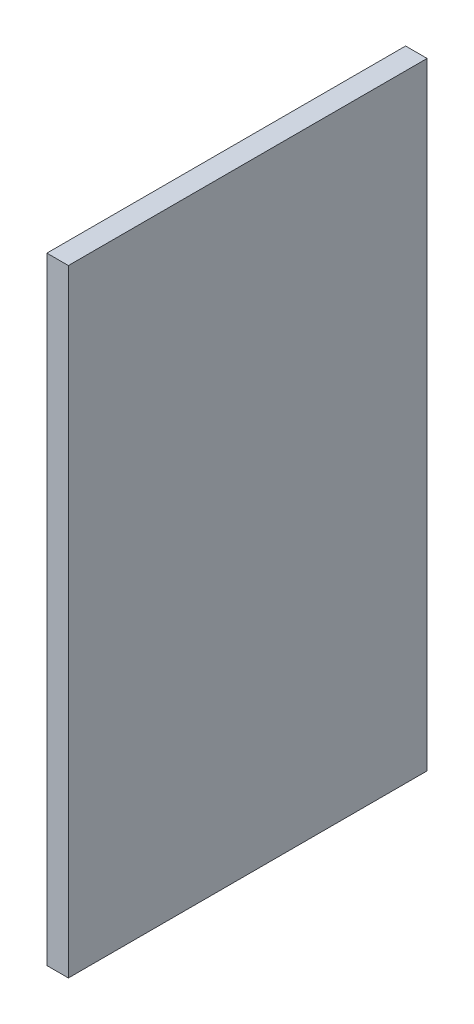
ISO-10303-21;
HEADER;
FILE_DESCRIPTION(('STEP AP214'),'2;1');
FILE_NAME('part.step','',(''),(''),'','','');
FILE_SCHEMA(('AUTOMOTIVE_DESIGN { 1 0 10303 214 1 1 1 1 }'));
ENDSEC;
DATA;
#1=APPLICATION_CONTEXT('core data for automotive mechanical design processes');
#2=APPLICATION_PROTOCOL_DEFINITION('international standard','automotive_design',2000,#1);
#3=PRODUCT_CONTEXT('',#1,'mechanical');
#4=PRODUCT('Part','Part','',(#3));
#5=PRODUCT_RELATED_PRODUCT_CATEGORY('part','',(#4));
#6=PRODUCT_DEFINITION_FORMATION('','',#4);
#7=PRODUCT_DEFINITION_CONTEXT('part definition',#1,'design');
#8=PRODUCT_DEFINITION('design','',#6,#7);
#9=PRODUCT_DEFINITION_SHAPE('','',#8);
#10=(LENGTH_UNIT() NAMED_UNIT(*) SI_UNIT(.MILLI.,.METRE.));
#11=(NAMED_UNIT(*) PLANE_ANGLE_UNIT() SI_UNIT($,.RADIAN.));
#12=(NAMED_UNIT(*) SI_UNIT($,.STERADIAN.) SOLID_ANGLE_UNIT());
#13=UNCERTAINTY_MEASURE_WITH_UNIT(LENGTH_MEASURE(1.E-05),#10,'distance_accuracy_value','');
#14=(GEOMETRIC_REPRESENTATION_CONTEXT(3) GLOBAL_UNCERTAINTY_ASSIGNED_CONTEXT((#13)) GLOBAL_UNIT_ASSIGNED_CONTEXT((#10,
#11,#12)) REPRESENTATION_CONTEXT('',''));
#15=CARTESIAN_POINT('',(0.,0.,0.));
#16=DIRECTION('',(0.,0.,1.));
#17=DIRECTION('',(1.,0.,0.));
#18=AXIS2_PLACEMENT_3D('',#15,#16,#17);
#19=CARTESIAN_POINT('',(15.,215.,125.));
#20=DIRECTION('',(0.,0.,-1.));
#21=DIRECTION('',(0.,1.,0.));
#22=AXIS2_PLACEMENT_3D('',#19,#20,#21);
#23=PLANE('',#22);
#24=DIRECTION('',(0.,-1.,0.));
#25=VECTOR('',#24,1.);
#26=CARTESIAN_POINT('',(0.,215.,125.));
#27=LINE('',#26,#25);
#28=CARTESIAN_POINT('',(0.,215.,125.));
#29=VERTEX_POINT('',#28);
#30=CARTESIAN_POINT('',(0.,-215.,125.));
#31=VERTEX_POINT('',#30);
#32=EDGE_CURVE('E104',#29,#31,#27,.T.);
#33=ORIENTED_EDGE('',*,*,#32,.T.);
#34=DIRECTION('',(-1.,0.,0.));
#35=VECTOR('',#34,1.);
#36=CARTESIAN_POINT('',(15.,-215.,125.));
#37=LINE('',#36,#35);
#38=CARTESIAN_POINT('',(15.,-215.,125.));
#39=VERTEX_POINT('',#38);
#40=EDGE_CURVE('E46',#39,#31,#37,.T.);
#41=ORIENTED_EDGE('',*,*,#40,.F.);
#42=DIRECTION('',(0.,-1.,0.));
#43=VECTOR('',#42,1.);
#44=CARTESIAN_POINT('',(15.,215.,125.));
#45=LINE('',#44,#43);
#46=CARTESIAN_POINT('',(15.,215.,125.));
#47=VERTEX_POINT('',#46);
#48=EDGE_CURVE('E90',#47,#39,#45,.T.);
#49=ORIENTED_EDGE('',*,*,#48,.F.);
#50=DIRECTION('',(-1.,0.,0.));
#51=VECTOR('',#50,1.);
#52=CARTESIAN_POINT('',(15.,215.,125.));
#53=LINE('',#52,#51);
#54=EDGE_CURVE('E100',#47,#29,#53,.T.);
#55=ORIENTED_EDGE('',*,*,#54,.T.);
#56=EDGE_LOOP('',(#33,#41,#49,#55));
#57=FACE_BOUND('',#56,.T.);
#58=ADVANCED_FACE('F38',(#57),#23,.F.);
#59=CARTESIAN_POINT('',(15.,-215.,125.));
#60=DIRECTION('',(0.,1.,0.));
#61=DIRECTION('',(0.,0.,1.));
#62=AXIS2_PLACEMENT_3D('',#59,#60,#61);
#63=PLANE('',#62);
#64=DIRECTION('',(0.,0.,-1.));
#65=VECTOR('',#64,1.);
#66=CARTESIAN_POINT('',(0.,-215.,125.));
#67=LINE('',#66,#65);
#68=CARTESIAN_POINT('',(0.,-215.,-125.));
#69=VERTEX_POINT('',#68);
#70=EDGE_CURVE('E95',#31,#69,#67,.T.);
#71=ORIENTED_EDGE('',*,*,#70,.T.);
#72=DIRECTION('',(-1.,0.,0.));
#73=VECTOR('',#72,1.);
#74=CARTESIAN_POINT('',(15.,-215.,-125.));
#75=LINE('',#74,#73);
#76=CARTESIAN_POINT('',(15.,-215.,-125.));
#77=VERTEX_POINT('',#76);
#78=EDGE_CURVE('E93',#77,#69,#75,.T.);
#79=ORIENTED_EDGE('',*,*,#78,.F.);
#80=DIRECTION('',(0.,0.,-1.));
#81=VECTOR('',#80,1.);
#82=CARTESIAN_POINT('',(15.,-215.,125.));
#83=LINE('',#82,#81);
#84=EDGE_CURVE('E85',#39,#77,#83,.T.);
#85=ORIENTED_EDGE('',*,*,#84,.F.);
#86=ORIENTED_EDGE('',*,*,#40,.T.);
#87=EDGE_LOOP('',(#71,#79,#85,#86));
#88=FACE_BOUND('',#87,.T.);
#89=ADVANCED_FACE('F94',(#88),#63,.F.);
#90=CARTESIAN_POINT('',(15.,215.,-125.));
#91=DIRECTION('',(0.,0.,1.));
#92=DIRECTION('',(0.,-1.,0.));
#93=AXIS2_PLACEMENT_3D('',#90,#91,#92);
#94=PLANE('',#93);
#95=DIRECTION('',(0.,1.,0.));
#96=VECTOR('',#95,1.);
#97=CARTESIAN_POINT('',(0.,215.,-125.));
#98=LINE('',#97,#96);
#99=CARTESIAN_POINT('',(0.,215.,-125.));
#100=VERTEX_POINT('',#99);
#101=EDGE_CURVE('E71',#69,#100,#98,.T.);
#102=ORIENTED_EDGE('',*,*,#101,.T.);
#103=DIRECTION('',(-1.,0.,0.));
#104=VECTOR('',#103,1.);
#105=CARTESIAN_POINT('',(15.,215.,-125.));
#106=LINE('',#105,#104);
#107=CARTESIAN_POINT('',(15.,215.,-125.));
#108=VERTEX_POINT('',#107);
#109=EDGE_CURVE('E96',#108,#100,#106,.T.);
#110=ORIENTED_EDGE('',*,*,#109,.F.);
#111=DIRECTION('',(0.,1.,0.));
#112=VECTOR('',#111,1.);
#113=CARTESIAN_POINT('',(15.,215.,-125.));
#114=LINE('',#113,#112);
#115=EDGE_CURVE('E88',#77,#108,#114,.T.);
#116=ORIENTED_EDGE('',*,*,#115,.F.);
#117=ORIENTED_EDGE('',*,*,#78,.T.);
#118=EDGE_LOOP('',(#102,#110,#116,#117));
#119=FACE_BOUND('',#118,.T.);
#120=ADVANCED_FACE('F98',(#119),#94,.F.);
#121=CARTESIAN_POINT('',(15.,215.,125.));
#122=DIRECTION('',(0.,-1.,0.));
#123=DIRECTION('',(0.,0.,-1.));
#124=AXIS2_PLACEMENT_3D('',#121,#122,#123);
#125=PLANE('',#124);
#126=DIRECTION('',(0.,0.,1.));
#127=VECTOR('',#126,1.);
#128=CARTESIAN_POINT('',(0.,215.,125.));
#129=LINE('',#128,#127);
#130=EDGE_CURVE('E77',#100,#29,#129,.T.);
#131=ORIENTED_EDGE('',*,*,#130,.T.);
#132=ORIENTED_EDGE('',*,*,#54,.F.);
#133=DIRECTION('',(0.,0.,1.));
#134=VECTOR('',#133,1.);
#135=CARTESIAN_POINT('',(15.,215.,125.));
#136=LINE('',#135,#134);
#137=EDGE_CURVE('E54',#108,#47,#136,.T.);
#138=ORIENTED_EDGE('',*,*,#137,.F.);
#139=ORIENTED_EDGE('',*,*,#109,.T.);
#140=EDGE_LOOP('',(#131,#132,#138,#139));
#141=FACE_BOUND('',#140,.T.);
#142=ADVANCED_FACE('F125',(#141),#125,.F.);
#143=CARTESIAN_POINT('',(15.,0.,0.));
#144=DIRECTION('',(1.,0.,0.));
#145=DIRECTION('',(0.,0.,-1.));
#146=AXIS2_PLACEMENT_3D('',#143,#144,#145);
#147=PLANE('',#146);
#148=ORIENTED_EDGE('',*,*,#48,.T.);
#149=ORIENTED_EDGE('',*,*,#84,.T.);
#150=ORIENTED_EDGE('',*,*,#115,.T.);
#151=ORIENTED_EDGE('',*,*,#137,.T.);
#152=EDGE_LOOP('',(#148,#149,#150,#151));
#153=FACE_BOUND('',#152,.T.);
#154=ADVANCED_FACE('F86',(#153),#147,.T.);
#155=CARTESIAN_POINT('',(0.,0.,0.));
#156=DIRECTION('',(1.,0.,0.));
#157=DIRECTION('',(0.,0.,-1.));
#158=AXIS2_PLACEMENT_3D('',#155,#156,#157);
#159=PLANE('',#158);
#160=CARTESIAN_POINT('',(0.,0.,0.));
#161=DIRECTION('',(1.,0.,0.));
#162=DIRECTION('',(0.,0.,-1.));
#163=AXIS2_PLACEMENT_3D('',#160,#161,#162);
#164=CIRCLE('',#163,25.);
#165=CARTESIAN_POINT('',(0.,0.,-25.));
#166=VERTEX_POINT('',#165);
#167=EDGE_CURVE('E11',#166,#166,#164,.F.);
#168=ORIENTED_EDGE('',*,*,#167,.F.);
#169=EDGE_LOOP('',(#168));
#170=FACE_BOUND('',#169,.T.);
#171=ORIENTED_EDGE('',*,*,#32,.F.);
#172=ORIENTED_EDGE('',*,*,#130,.F.);
#173=ORIENTED_EDGE('',*,*,#101,.F.);
#174=ORIENTED_EDGE('',*,*,#70,.F.);
#175=EDGE_LOOP('',(#171,#172,#173,#174));
#176=FACE_BOUND('',#175,.T.);
#177=ADVANCED_FACE('F114',(#170,#176),#159,.F.);
#178=CARTESIAN_POINT('',(0.,0.,0.));
#179=DIRECTION('',(0.,0.,1.));
#180=DIRECTION('',(0.,1.,0.));
#181=AXIS2_PLACEMENT_3D('',#178,#179,#180);
#182=SPHERICAL_SURFACE('',#181,25.);
#183=CARTESIAN_POINT('',(0.,0.,0.));
#184=DIRECTION('',(1.,0.,0.));
#185=DIRECTION('',(0.,0.,-1.));
#186=AXIS2_PLACEMENT_3D('',#183,#184,#185);
#187=SPHERICAL_SURFACE('',#186,25.);
#188=ORIENTED_EDGE('',*,*,#167,.T.);
#189=EDGE_LOOP('',(#188));
#190=FACE_BOUND('',#189,.T.);
#191=ADVANCED_FACE('F116',(#190),#187,.T.);
#192=CLOSED_SHELL('',(#58,#89,#120,#142,#154,#177,#191));
#193=MANIFOLD_SOLID_BREP('B2',#192);
#194=ADVANCED_BREP_SHAPE_REPRESENTATION('',(#18,#193),#14);
#195=SHAPE_DEFINITION_REPRESENTATION(#9,#194);
ENDSEC;
END-ISO-10303-21;
